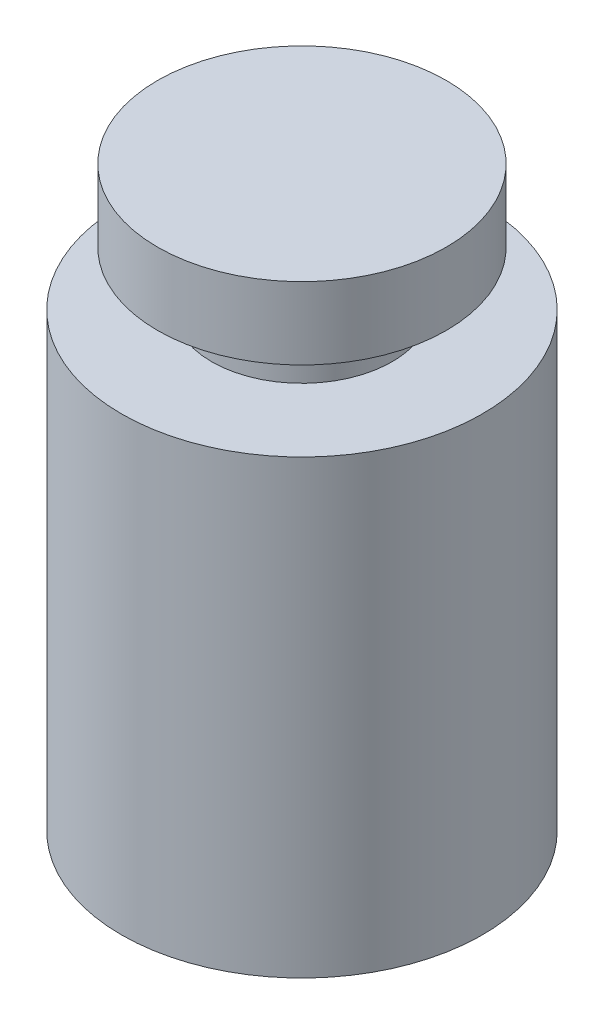
ISO-10303-21;
HEADER;
FILE_DESCRIPTION(('STEP AP214'),'2;1');
FILE_NAME('part.step','',(''),(''),'','','');
FILE_SCHEMA(('AUTOMOTIVE_DESIGN { 1 0 10303 214 1 1 1 1 }'));
ENDSEC;
DATA;
#1=APPLICATION_CONTEXT('core data for automotive mechanical design processes');
#2=APPLICATION_PROTOCOL_DEFINITION('international standard','automotive_design',2000,#1);
#3=PRODUCT_CONTEXT('',#1,'mechanical');
#4=PRODUCT('Part','Part','',(#3));
#5=PRODUCT_RELATED_PRODUCT_CATEGORY('part','',(#4));
#6=PRODUCT_DEFINITION_FORMATION('','',#4);
#7=PRODUCT_DEFINITION_CONTEXT('part definition',#1,'design');
#8=PRODUCT_DEFINITION('design','',#6,#7);
#9=PRODUCT_DEFINITION_SHAPE('','',#8);
#10=(LENGTH_UNIT() NAMED_UNIT(*) SI_UNIT(.MILLI.,.METRE.));
#11=(NAMED_UNIT(*) PLANE_ANGLE_UNIT() SI_UNIT($,.RADIAN.));
#12=(NAMED_UNIT(*) SI_UNIT($,.STERADIAN.) SOLID_ANGLE_UNIT());
#13=UNCERTAINTY_MEASURE_WITH_UNIT(LENGTH_MEASURE(1.E-05),#10,'distance_accuracy_value','');
#14=(GEOMETRIC_REPRESENTATION_CONTEXT(3) GLOBAL_UNCERTAINTY_ASSIGNED_CONTEXT((#13)) GLOBAL_UNIT_ASSIGNED_CONTEXT((#10,
#11,#12)) REPRESENTATION_CONTEXT('',''));
#15=CARTESIAN_POINT('',(0.,0.,0.));
#16=DIRECTION('',(0.,0.,1.));
#17=DIRECTION('',(1.,0.,0.));
#18=AXIS2_PLACEMENT_3D('',#15,#16,#17);
#19=CARTESIAN_POINT('',(0.,0.,0.));
#20=DIRECTION('',(0.,-1.,0.));
#21=DIRECTION('',(0.,0.,-1.));
#22=AXIS2_PLACEMENT_3D('',#19,#20,#21);
#23=PLANE('',#22);
#24=CARTESIAN_POINT('',(0.,0.,0.));
#25=DIRECTION('',(0.,1.,0.));
#26=DIRECTION('',(0.,0.,1.));
#27=AXIS2_PLACEMENT_3D('',#24,#25,#26);
#28=CIRCLE('',#27,10.);
#29=CARTESIAN_POINT('',(0.,0.,10.));
#30=VERTEX_POINT('',#29);
#31=EDGE_CURVE('E10',#30,#30,#28,.T.);
#32=ORIENTED_EDGE('',*,*,#31,.F.);
#33=EDGE_LOOP('',(#32));
#34=FACE_BOUND('',#33,.T.);
#35=ADVANCED_FACE('F39',(#34),#23,.T.);
#36=CARTESIAN_POINT('',(0.,43.8679245283018,0.));
#37=DIRECTION('',(0.,1.,0.));
#38=DIRECTION('',(0.,0.,1.));
#39=AXIS2_PLACEMENT_3D('',#36,#37,#38);
#40=CYLINDRICAL_SURFACE('',#39,10.);
#41=ORIENTED_EDGE('',*,*,#31,.T.);
#42=EDGE_LOOP('',(#41));
#43=FACE_BOUND('',#42,.T.);
#44=CARTESIAN_POINT('',(0.,25.,0.));
#45=DIRECTION('',(0.,1.,0.));
#46=DIRECTION('',(0.,0.,1.));
#47=AXIS2_PLACEMENT_3D('',#44,#45,#46);
#48=CIRCLE('',#47,10.);
#49=CARTESIAN_POINT('',(0.,25.,10.));
#50=VERTEX_POINT('',#49);
#51=EDGE_CURVE('E46',#50,#50,#48,.T.);
#52=ORIENTED_EDGE('',*,*,#51,.F.);
#53=EDGE_LOOP('',(#52));
#54=FACE_BOUND('',#53,.T.);
#55=ADVANCED_FACE('F87',(#43,#54),#40,.T.);
#56=CARTESIAN_POINT('',(-10.,25.,0.));
#57=DIRECTION('',(0.,1.,0.));
#58=DIRECTION('',(0.,0.,1.));
#59=AXIS2_PLACEMENT_3D('',#56,#57,#58);
#60=PLANE('',#59);
#61=ORIENTED_EDGE('',*,*,#51,.T.);
#62=EDGE_LOOP('',(#61));
#63=FACE_BOUND('',#62,.T.);
#64=CARTESIAN_POINT('',(0.,25.,0.));
#65=DIRECTION('',(0.,1.,0.));
#66=DIRECTION('',(0.,0.,1.));
#67=AXIS2_PLACEMENT_3D('',#64,#65,#66);
#68=CIRCLE('',#67,5.);
#69=CARTESIAN_POINT('',(0.,25.,5.));
#70=VERTEX_POINT('',#69);
#71=EDGE_CURVE('E51',#70,#70,#68,.T.);
#72=ORIENTED_EDGE('',*,*,#71,.F.);
#73=EDGE_LOOP('',(#72));
#74=FACE_BOUND('',#73,.T.);
#75=ADVANCED_FACE('F92',(#63,#74),#60,.T.);
#76=CARTESIAN_POINT('',(0.,43.8679245283018,0.));
#77=DIRECTION('',(0.,1.,0.));
#78=DIRECTION('',(0.,0.,1.));
#79=AXIS2_PLACEMENT_3D('',#76,#77,#78);
#80=CYLINDRICAL_SURFACE('',#79,5.);
#81=ORIENTED_EDGE('',*,*,#71,.T.);
#82=EDGE_LOOP('',(#81));
#83=FACE_BOUND('',#82,.T.);
#84=CARTESIAN_POINT('',(0.,28.,0.));
#85=DIRECTION('',(0.,1.,0.));
#86=DIRECTION('',(0.,0.,1.));
#87=AXIS2_PLACEMENT_3D('',#84,#85,#86);
#88=CIRCLE('',#87,4.99999999999999);
#89=CARTESIAN_POINT('',(0.,28.,4.99999999999999));
#90=VERTEX_POINT('',#89);
#91=EDGE_CURVE('E56',#90,#90,#88,.T.);
#92=ORIENTED_EDGE('',*,*,#91,.F.);
#93=EDGE_LOOP('',(#92));
#94=FACE_BOUND('',#93,.T.);
#95=ADVANCED_FACE('F83',(#83,#94),#80,.T.);
#96=CARTESIAN_POINT('',(-4.99999999999999,28.,0.));
#97=DIRECTION('',(0.,-1.,0.));
#98=DIRECTION('',(0.,0.,-1.));
#99=AXIS2_PLACEMENT_3D('',#96,#97,#98);
#100=PLANE('',#99);
#101=ORIENTED_EDGE('',*,*,#91,.T.);
#102=EDGE_LOOP('',(#101));
#103=FACE_BOUND('',#102,.T.);
#104=CARTESIAN_POINT('',(0.,28.,0.));
#105=DIRECTION('',(0.,1.,0.));
#106=DIRECTION('',(0.,0.,1.));
#107=AXIS2_PLACEMENT_3D('',#104,#105,#106);
#108=CIRCLE('',#107,7.99999999999995);
#109=CARTESIAN_POINT('',(0.,28.,7.99999999999995));
#110=VERTEX_POINT('',#109);
#111=EDGE_CURVE('E62',#110,#110,#108,.T.);
#112=ORIENTED_EDGE('',*,*,#111,.F.);
#113=EDGE_LOOP('',(#112));
#114=FACE_BOUND('',#113,.T.);
#115=ADVANCED_FACE('F75',(#103,#114),#100,.T.);
#116=CARTESIAN_POINT('',(0.,43.8679245283018,0.));
#117=DIRECTION('',(0.,1.,0.));
#118=DIRECTION('',(0.,0.,1.));
#119=AXIS2_PLACEMENT_3D('',#116,#117,#118);
#120=CYLINDRICAL_SURFACE('',#119,7.99999999999998);
#121=ORIENTED_EDGE('',*,*,#111,.T.);
#122=EDGE_LOOP('',(#121));
#123=FACE_BOUND('',#122,.T.);
#124=CARTESIAN_POINT('',(0.,32.,0.));
#125=DIRECTION('',(0.,1.,0.));
#126=DIRECTION('',(0.,0.,1.));
#127=AXIS2_PLACEMENT_3D('',#124,#125,#126);
#128=CIRCLE('',#127,8.);
#129=CARTESIAN_POINT('',(0.,32.,8.));
#130=VERTEX_POINT('',#129);
#131=EDGE_CURVE('E66',#130,#130,#128,.T.);
#132=ORIENTED_EDGE('',*,*,#131,.F.);
#133=EDGE_LOOP('',(#132));
#134=FACE_BOUND('',#133,.T.);
#135=ADVANCED_FACE('F73',(#123,#134),#120,.T.);
#136=CARTESIAN_POINT('',(-8.,32.,0.));
#137=DIRECTION('',(0.,1.,0.));
#138=DIRECTION('',(0.,0.,1.));
#139=AXIS2_PLACEMENT_3D('',#136,#137,#138);
#140=PLANE('',#139);
#141=ORIENTED_EDGE('',*,*,#131,.T.);
#142=EDGE_LOOP('',(#141));
#143=FACE_BOUND('',#142,.T.);
#144=ADVANCED_FACE('F71',(#143),#140,.T.);
#145=CLOSED_SHELL('',(#35,#55,#75,#95,#115,#135,#144));
#146=MANIFOLD_SOLID_BREP('B2',#145);
#147=ADVANCED_BREP_SHAPE_REPRESENTATION('',(#18,#146),#14);
#148=SHAPE_DEFINITION_REPRESENTATION(#9,#147);
ENDSEC;
END-ISO-10303-21;
